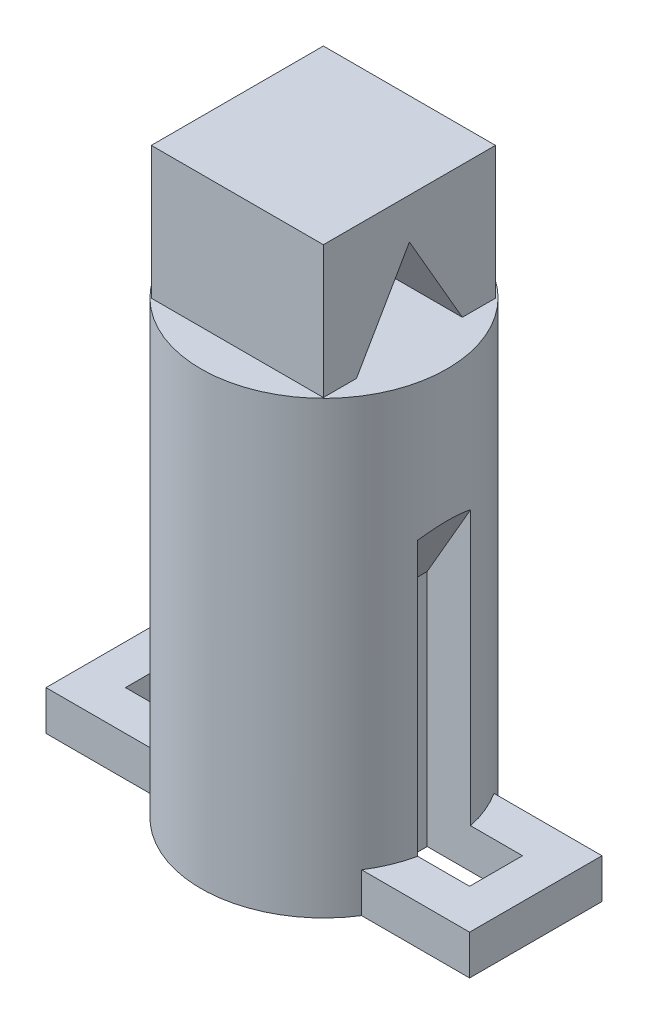
ISO-10303-21;
HEADER;
FILE_DESCRIPTION(('STEP AP214'),'2;1');
FILE_NAME('part.step','',(''),(''),'','','');
FILE_SCHEMA(('AUTOMOTIVE_DESIGN { 1 0 10303 214 1 1 1 1 }'));
ENDSEC;
DATA;
#1=APPLICATION_CONTEXT('core data for automotive mechanical design processes');
#2=APPLICATION_PROTOCOL_DEFINITION('international standard','automotive_design',2000,#1);
#3=PRODUCT_CONTEXT('',#1,'mechanical');
#4=PRODUCT('Part','Part','',(#3));
#5=PRODUCT_RELATED_PRODUCT_CATEGORY('part','',(#4));
#6=PRODUCT_DEFINITION_FORMATION('','',#4);
#7=PRODUCT_DEFINITION_CONTEXT('part definition',#1,'design');
#8=PRODUCT_DEFINITION('design','',#6,#7);
#9=PRODUCT_DEFINITION_SHAPE('','',#8);
#10=(LENGTH_UNIT() NAMED_UNIT(*) SI_UNIT(.MILLI.,.METRE.));
#11=(NAMED_UNIT(*) PLANE_ANGLE_UNIT() SI_UNIT($,.RADIAN.));
#12=(NAMED_UNIT(*) SI_UNIT($,.STERADIAN.) SOLID_ANGLE_UNIT());
#13=UNCERTAINTY_MEASURE_WITH_UNIT(LENGTH_MEASURE(1.E-05),#10,'distance_accuracy_value','');
#14=(GEOMETRIC_REPRESENTATION_CONTEXT(3) GLOBAL_UNCERTAINTY_ASSIGNED_CONTEXT((#13)) GLOBAL_UNIT_ASSIGNED_CONTEXT((#10,
#11,#12)) REPRESENTATION_CONTEXT('',''));
#15=CARTESIAN_POINT('',(0.,0.,0.));
#16=DIRECTION('',(0.,0.,1.));
#17=DIRECTION('',(1.,0.,0.));
#18=AXIS2_PLACEMENT_3D('',#15,#16,#17);
#19=CARTESIAN_POINT('',(-6.5,10.,-6.45306212472906));
#20=DIRECTION('',(1.,0.,0.));
#21=DIRECTION('',(0.,0.,-1.));
#22=AXIS2_PLACEMENT_3D('',#19,#20,#21);
#23=PLANE('',#22);
#24=DIRECTION('',(0.,0.,1.));
#25=VECTOR('',#24,1.);
#26=CARTESIAN_POINT('',(-6.5,0.,-6.45306212472906));
#27=LINE('',#26,#25);
#28=CARTESIAN_POINT('',(-6.5,0.,-6.45306212472906));
#29=VERTEX_POINT('',#28);
#30=CARTESIAN_POINT('',(-6.5,0.,-3.95306212472906));
#31=VERTEX_POINT('',#30);
#32=EDGE_CURVE('E439',#29,#31,#27,.T.);
#33=ORIENTED_EDGE('',*,*,#32,.T.);
#34=DIRECTION('',(0.,0.86602540378444,0.499999999999998));
#35=VECTOR('',#34,1.);
#36=CARTESIAN_POINT('',(-6.5,6.41746824526948,-0.24793510580687));
#37=LINE('',#36,#35);
#38=CARTESIAN_POINT('',(-6.49999999999999,6.92820323027555,0.0469378752709429));
#39=VERTEX_POINT('',#38);
#40=EDGE_CURVE('E299',#31,#39,#37,.T.);
#41=ORIENTED_EDGE('',*,*,#40,.T.);
#42=DIRECTION('',(0.,-0.86602540378444,0.499999999999998));
#43=VECTOR('',#42,1.);
#44=CARTESIAN_POINT('',(-6.5,12.0466333698683,-2.90818914365122));
#45=LINE('',#44,#43);
#46=CARTESIAN_POINT('',(-6.49999999999999,0.,4.04693787527094));
#47=VERTEX_POINT('',#46);
#48=EDGE_CURVE('E291',#39,#47,#45,.T.);
#49=ORIENTED_EDGE('',*,*,#48,.T.);
#50=CARTESIAN_POINT('',(-6.5,0.,6.54693787527094));
#51=VERTEX_POINT('',#50);
#52=EDGE_CURVE('E444',#47,#51,#27,.T.);
#53=ORIENTED_EDGE('',*,*,#52,.T.);
#54=DIRECTION('',(0.,-1.,0.));
#55=VECTOR('',#54,1.);
#56=CARTESIAN_POINT('',(-6.5,10.,6.54693787527094));
#57=LINE('',#56,#55);
#58=CARTESIAN_POINT('',(-6.5,10.,6.54693787527094));
#59=VERTEX_POINT('',#58);
#60=EDGE_CURVE('E467',#59,#51,#57,.T.);
#61=ORIENTED_EDGE('',*,*,#60,.F.);
#62=DIRECTION('',(0.,0.,1.));
#63=VECTOR('',#62,1.);
#64=CARTESIAN_POINT('',(-6.5,10.,-6.45306212472906));
#65=LINE('',#64,#63);
#66=CARTESIAN_POINT('',(-6.5,10.,-6.45306212472906));
#67=VERTEX_POINT('',#66);
#68=EDGE_CURVE('E424',#67,#59,#65,.T.);
#69=ORIENTED_EDGE('',*,*,#68,.F.);
#70=DIRECTION('',(0.,-1.,0.));
#71=VECTOR('',#70,1.);
#72=CARTESIAN_POINT('',(-6.5,10.,-6.45306212472906));
#73=LINE('',#72,#71);
#74=EDGE_CURVE('E438',#67,#29,#73,.T.);
#75=ORIENTED_EDGE('',*,*,#74,.T.);
#76=EDGE_LOOP('',(#33,#41,#49,#53,#61,#69,#75));
#77=FACE_BOUND('',#76,.T.);
#78=ADVANCED_FACE('F39',(#77),#23,.F.);
#79=CARTESIAN_POINT('',(6.5,10.,6.54693787527094));
#80=DIRECTION('',(0.,0.,-1.));
#81=DIRECTION('',(-1.,0.,0.));
#82=AXIS2_PLACEMENT_3D('',#79,#80,#81);
#83=PLANE('',#82);
#84=DIRECTION('',(1.,0.,0.));
#85=VECTOR('',#84,1.);
#86=CARTESIAN_POINT('',(6.5,0.,6.54693787527094));
#87=LINE('',#86,#85);
#88=CARTESIAN_POINT('',(6.5,0.,6.54693787527094));
#89=VERTEX_POINT('',#88);
#90=EDGE_CURVE('E443',#51,#89,#87,.T.);
#91=ORIENTED_EDGE('',*,*,#90,.T.);
#92=DIRECTION('',(0.,-1.,0.));
#93=VECTOR('',#92,1.);
#94=CARTESIAN_POINT('',(6.5,10.,6.54693787527094));
#95=LINE('',#94,#93);
#96=CARTESIAN_POINT('',(6.5,10.,6.54693787527094));
#97=VERTEX_POINT('',#96);
#98=EDGE_CURVE('E463',#97,#89,#95,.T.);
#99=ORIENTED_EDGE('',*,*,#98,.F.);
#100=DIRECTION('',(1.,0.,0.));
#101=VECTOR('',#100,1.);
#102=CARTESIAN_POINT('',(6.5,10.,6.54693787527094));
#103=LINE('',#102,#101);
#104=EDGE_CURVE('E428',#59,#97,#103,.T.);
#105=ORIENTED_EDGE('',*,*,#104,.F.);
#106=ORIENTED_EDGE('',*,*,#60,.T.);
#107=EDGE_LOOP('',(#91,#99,#105,#106));
#108=FACE_BOUND('',#107,.T.);
#109=ADVANCED_FACE('F573',(#108),#83,.F.);
#110=CARTESIAN_POINT('',(6.5,10.,-6.45306212472906));
#111=DIRECTION('',(-1.,0.,0.));
#112=DIRECTION('',(0.,0.,1.));
#113=AXIS2_PLACEMENT_3D('',#110,#111,#112);
#114=PLANE('',#113);
#115=DIRECTION('',(0.,0.86602540378444,-0.499999999999998));
#116=VECTOR('',#115,1.);
#117=CARTESIAN_POINT('',(6.5,12.0466333698683,-2.90818914365122));
#118=LINE('',#117,#116);
#119=CARTESIAN_POINT('',(6.5,0.,4.04693787527094));
#120=VERTEX_POINT('',#119);
#121=CARTESIAN_POINT('',(6.5,6.92820323027555,0.0469378752709412));
#122=VERTEX_POINT('',#121);
#123=EDGE_CURVE('E282',#120,#122,#118,.T.);
#124=ORIENTED_EDGE('',*,*,#123,.T.);
#125=DIRECTION('',(0.,-0.86602540378444,-0.499999999999998));
#126=VECTOR('',#125,1.);
#127=CARTESIAN_POINT('',(6.5,6.41746824526948,-0.247935105806871));
#128=LINE('',#127,#126);
#129=CARTESIAN_POINT('',(6.5,0.,-3.95306212472906));
#130=VERTEX_POINT('',#129);
#131=EDGE_CURVE('E295',#122,#130,#128,.T.);
#132=ORIENTED_EDGE('',*,*,#131,.T.);
#133=DIRECTION('',(0.,0.,-1.));
#134=VECTOR('',#133,1.);
#135=CARTESIAN_POINT('',(6.5,0.,-6.45306212472906));
#136=LINE('',#135,#134);
#137=CARTESIAN_POINT('',(6.5,0.,-6.45306212472906));
#138=VERTEX_POINT('',#137);
#139=EDGE_CURVE('E448',#130,#138,#136,.T.);
#140=ORIENTED_EDGE('',*,*,#139,.T.);
#141=DIRECTION('',(0.,-1.,0.));
#142=VECTOR('',#141,1.);
#143=CARTESIAN_POINT('',(6.5,10.,-6.45306212472906));
#144=LINE('',#143,#142);
#145=CARTESIAN_POINT('',(6.5,10.,-6.45306212472906));
#146=VERTEX_POINT('',#145);
#147=EDGE_CURVE('E459',#146,#138,#144,.T.);
#148=ORIENTED_EDGE('',*,*,#147,.F.);
#149=DIRECTION('',(0.,0.,-1.));
#150=VECTOR('',#149,1.);
#151=CARTESIAN_POINT('',(6.5,10.,-6.45306212472906));
#152=LINE('',#151,#150);
#153=EDGE_CURVE('E432',#97,#146,#152,.T.);
#154=ORIENTED_EDGE('',*,*,#153,.F.);
#155=ORIENTED_EDGE('',*,*,#98,.T.);
#156=EDGE_CURVE('E449',#89,#120,#136,.T.);
#157=ORIENTED_EDGE('',*,*,#156,.T.);
#158=EDGE_LOOP('',(#124,#132,#140,#148,#154,#155,#157));
#159=FACE_BOUND('',#158,.T.);
#160=ADVANCED_FACE('F579',(#159),#114,.F.);
#161=CARTESIAN_POINT('',(6.5,10.,-6.45306212472906));
#162=DIRECTION('',(0.,0.,1.));
#163=DIRECTION('',(1.,0.,0.));
#164=AXIS2_PLACEMENT_3D('',#161,#162,#163);
#165=PLANE('',#164);
#166=DIRECTION('',(-1.,0.,0.));
#167=VECTOR('',#166,1.);
#168=CARTESIAN_POINT('',(6.5,0.,-6.45306212472906));
#169=LINE('',#168,#167);
#170=EDGE_CURVE('E429',#138,#29,#169,.T.);
#171=ORIENTED_EDGE('',*,*,#170,.T.);
#172=ORIENTED_EDGE('',*,*,#74,.F.);
#173=DIRECTION('',(-1.,0.,0.));
#174=VECTOR('',#173,1.);
#175=CARTESIAN_POINT('',(6.5,10.,-6.45306212472906));
#176=LINE('',#175,#174);
#177=EDGE_CURVE('E435',#146,#67,#176,.T.);
#178=ORIENTED_EDGE('',*,*,#177,.F.);
#179=ORIENTED_EDGE('',*,*,#147,.T.);
#180=EDGE_LOOP('',(#171,#172,#178,#179));
#181=FACE_BOUND('',#180,.T.);
#182=ADVANCED_FACE('F739',(#181),#165,.F.);
#183=CARTESIAN_POINT('',(0.,10.,0.));
#184=DIRECTION('',(0.,-1.,0.));
#185=DIRECTION('',(0.,0.,-1.));
#186=AXIS2_PLACEMENT_3D('',#183,#184,#185);
#187=PLANE('',#186);
#188=ORIENTED_EDGE('',*,*,#68,.T.);
#189=ORIENTED_EDGE('',*,*,#104,.T.);
#190=ORIENTED_EDGE('',*,*,#153,.T.);
#191=ORIENTED_EDGE('',*,*,#177,.T.);
#192=EDGE_LOOP('',(#188,#189,#190,#191));
#193=FACE_BOUND('',#192,.T.);
#194=ADVANCED_FACE('F758',(#193),#187,.F.);
#195=CARTESIAN_POINT('',(0.,-34.,0.));
#196=DIRECTION('',(0.,1.,0.));
#197=DIRECTION('',(0.,0.,1.));
#198=AXIS2_PLACEMENT_3D('',#195,#196,#197);
#199=CYLINDRICAL_SURFACE('',#198,9.3);
#200=CARTESIAN_POINT('',(0.,-31.,0.));
#201=DIRECTION('',(0.,-1.,0.));
#202=DIRECTION('',(0.,0.,-1.));
#203=AXIS2_PLACEMENT_3D('',#200,#201,#202);
#204=CIRCLE('',#203,9.3);
#205=CARTESIAN_POINT('',(-9.08240056372763,-31.,-2.));
#206=VERTEX_POINT('',#205);
#207=CARTESIAN_POINT('',(-7.84155596804614,-31.,-5.));
#208=VERTEX_POINT('',#207);
#209=EDGE_CURVE('E547',#206,#208,#204,.T.);
#210=ORIENTED_EDGE('',*,*,#209,.F.);
#211=DIRECTION('',(0.,1.,0.));
#212=VECTOR('',#211,1.);
#213=CARTESIAN_POINT('',(-9.08240056372763,-34.,-2.));
#214=LINE('',#213,#212);
#215=CARTESIAN_POINT('',(-9.08240056372763,-10.3147154528311,-2.));
#216=VERTEX_POINT('',#215);
#217=EDGE_CURVE('E268',#206,#216,#214,.T.);
#218=ORIENTED_EDGE('',*,*,#217,.T.);
#219=CARTESIAN_POINT('',(0.,-26.0458946838994,0.));
#220=DIRECTION('',(0.866025403784435,0.500000000000006,0.));
#221=DIRECTION('',(-0.500000000000006,0.866025403784435,0.));
#222=AXIS2_PLACEMENT_3D('',#219,#220,#221);
#223=ELLIPSE('',#222,18.5999999999998,9.3);
#224=CARTESIAN_POINT('',(-9.08240056372763,-10.3147154528311,2.));
#225=VERTEX_POINT('',#224);
#226=EDGE_CURVE('E11',#216,#225,#223,.T.);
#227=ORIENTED_EDGE('',*,*,#226,.T.);
#228=DIRECTION('',(0.,1.,0.));
#229=VECTOR('',#228,1.);
#230=CARTESIAN_POINT('',(-9.08240056372763,-34.,2.));
#231=LINE('',#230,#229);
#232=CARTESIAN_POINT('',(-9.08240056372763,-31.,2.));
#233=VERTEX_POINT('',#232);
#234=EDGE_CURVE('E233',#225,#233,#231,.F.);
#235=ORIENTED_EDGE('',*,*,#234,.T.);
#236=CARTESIAN_POINT('',(-7.84155596804614,-31.,5.));
#237=VERTEX_POINT('',#236);
#238=EDGE_CURVE('E476',#237,#233,#204,.T.);
#239=ORIENTED_EDGE('',*,*,#238,.F.);
#240=DIRECTION('',(0.,1.,0.));
#241=VECTOR('',#240,1.);
#242=CARTESIAN_POINT('',(-7.84155596804614,-34.,5.));
#243=LINE('',#242,#241);
#244=CARTESIAN_POINT('',(-7.84155596804614,-34.,5.));
#245=VERTEX_POINT('',#244);
#246=EDGE_CURVE('E394',#237,#245,#243,.F.);
#247=ORIENTED_EDGE('',*,*,#246,.T.);
#248=CARTESIAN_POINT('',(0.,-34.,0.));
#249=DIRECTION('',(0.,-1.,0.));
#250=DIRECTION('',(0.,0.,-1.));
#251=AXIS2_PLACEMENT_3D('',#248,#249,#250);
#252=CIRCLE('',#251,9.3);
#253=CARTESIAN_POINT('',(7.84155596804614,-34.,5.));
#254=VERTEX_POINT('',#253);
#255=EDGE_CURVE('E420',#254,#245,#252,.T.);
#256=ORIENTED_EDGE('',*,*,#255,.F.);
#257=DIRECTION('',(0.,1.,0.));
#258=VECTOR('',#257,1.);
#259=CARTESIAN_POINT('',(7.84155596804614,-34.,5.));
#260=LINE('',#259,#258);
#261=CARTESIAN_POINT('',(7.84155596804614,-31.,5.));
#262=VERTEX_POINT('',#261);
#263=EDGE_CURVE('E406',#254,#262,#260,.T.);
#264=ORIENTED_EDGE('',*,*,#263,.T.);
#265=CARTESIAN_POINT('',(9.08240056372763,-31.,2.));
#266=VERTEX_POINT('',#265);
#267=EDGE_CURVE('E475',#266,#262,#204,.T.);
#268=ORIENTED_EDGE('',*,*,#267,.F.);
#269=DIRECTION('',(0.,1.,0.));
#270=VECTOR('',#269,1.);
#271=CARTESIAN_POINT('',(9.08240056372763,-34.,2.));
#272=LINE('',#271,#270);
#273=CARTESIAN_POINT('',(9.08240056372763,-10.3147154528311,2.));
#274=VERTEX_POINT('',#273);
#275=EDGE_CURVE('E274',#266,#274,#272,.T.);
#276=ORIENTED_EDGE('',*,*,#275,.T.);
#277=CARTESIAN_POINT('',(0.,-26.0458946838994,0.));
#278=DIRECTION('',(-0.866025403784435,0.500000000000006,0.));
#279=DIRECTION('',(0.500000000000006,0.866025403784435,0.));
#280=AXIS2_PLACEMENT_3D('',#277,#278,#279);
#281=ELLIPSE('',#280,18.5999999999998,9.3);
#282=CARTESIAN_POINT('',(9.08240056372763,-10.3147154528311,-2.));
#283=VERTEX_POINT('',#282);
#284=EDGE_CURVE('E48',#274,#283,#281,.T.);
#285=ORIENTED_EDGE('',*,*,#284,.T.);
#286=DIRECTION('',(0.,1.,0.));
#287=VECTOR('',#286,1.);
#288=CARTESIAN_POINT('',(9.08240056372763,-34.,-2.));
#289=LINE('',#288,#287);
#290=CARTESIAN_POINT('',(9.08240056372763,-31.,-2.));
#291=VERTEX_POINT('',#290);
#292=EDGE_CURVE('E271',#283,#291,#289,.F.);
#293=ORIENTED_EDGE('',*,*,#292,.T.);
#294=CARTESIAN_POINT('',(7.84155596804614,-31.,-5.));
#295=VERTEX_POINT('',#294);
#296=EDGE_CURVE('E471',#295,#291,#204,.T.);
#297=ORIENTED_EDGE('',*,*,#296,.F.);
#298=DIRECTION('',(0.,1.,0.));
#299=VECTOR('',#298,1.);
#300=CARTESIAN_POINT('',(7.84155596804614,-34.,-5.));
#301=LINE('',#300,#299);
#302=CARTESIAN_POINT('',(7.84155596804614,-34.,-5.));
#303=VERTEX_POINT('',#302);
#304=EDGE_CURVE('E409',#295,#303,#301,.F.);
#305=ORIENTED_EDGE('',*,*,#304,.T.);
#306=CARTESIAN_POINT('',(-7.84155596804614,-34.,-5.));
#307=VERTEX_POINT('',#306);
#308=EDGE_CURVE('E416',#307,#303,#252,.T.);
#309=ORIENTED_EDGE('',*,*,#308,.F.);
#310=DIRECTION('',(0.,1.,0.));
#311=VECTOR('',#310,1.);
#312=CARTESIAN_POINT('',(-7.84155596804614,-34.,-5.));
#313=LINE('',#312,#311);
#314=EDGE_CURVE('E412',#307,#208,#313,.T.);
#315=ORIENTED_EDGE('',*,*,#314,.T.);
#316=EDGE_LOOP('',(#210,#218,#227,#235,#239,#247,#256,#264,#268,#276,#285,#293,#297,#305,#309,#315));
#317=FACE_BOUND('',#316,.T.);
#318=CARTESIAN_POINT('',(0.,0.,0.));
#319=DIRECTION('',(0.,-1.,0.));
#320=DIRECTION('',(0.,0.,-1.));
#321=AXIS2_PLACEMENT_3D('',#318,#319,#320);
#322=CIRCLE('',#321,9.3);
#323=CARTESIAN_POINT('',(0.,0.,-9.3));
#324=VERTEX_POINT('',#323);
#325=EDGE_CURVE('E415',#324,#324,#322,.T.);
#326=ORIENTED_EDGE('',*,*,#325,.T.);
#327=EDGE_LOOP('',(#326));
#328=FACE_BOUND('',#327,.T.);
#329=ADVANCED_FACE('F495',(#317,#328),#199,.T.);
#330=CARTESIAN_POINT('',(0.,-34.,0.));
#331=DIRECTION('',(0.,-1.,0.));
#332=DIRECTION('',(0.,0.,-1.));
#333=AXIS2_PLACEMENT_3D('',#330,#331,#332);
#334=PLANE('',#333);
#335=DIRECTION('',(0.,0.,1.));
#336=VECTOR('',#335,1.);
#337=CARTESIAN_POINT('',(-5.8,-34.,-2.));
#338=LINE('',#337,#336);
#339=CARTESIAN_POINT('',(-5.8,-34.,-2.));
#340=VERTEX_POINT('',#339);
#341=CARTESIAN_POINT('',(-5.8,-34.,2.));
#342=VERTEX_POINT('',#341);
#343=EDGE_CURVE('E230',#340,#342,#338,.T.);
#344=ORIENTED_EDGE('',*,*,#343,.F.);
#345=DIRECTION('',(1.,0.,0.));
#346=VECTOR('',#345,1.);
#347=CARTESIAN_POINT('',(-5.8,-34.,-2.));
#348=LINE('',#347,#346);
#349=CARTESIAN_POINT('',(-13.,-34.,-2.));
#350=VERTEX_POINT('',#349);
#351=EDGE_CURVE('E238',#350,#340,#348,.T.);
#352=ORIENTED_EDGE('',*,*,#351,.F.);
#353=DIRECTION('',(0.,0.,-1.));
#354=VECTOR('',#353,1.);
#355=CARTESIAN_POINT('',(-13.,-34.,2.));
#356=LINE('',#355,#354);
#357=CARTESIAN_POINT('',(-13.,-34.,2.));
#358=VERTEX_POINT('',#357);
#359=EDGE_CURVE('E246',#358,#350,#356,.T.);
#360=ORIENTED_EDGE('',*,*,#359,.F.);
#361=DIRECTION('',(-1.,0.,0.));
#362=VECTOR('',#361,1.);
#363=CARTESIAN_POINT('',(-5.8,-34.,2.));
#364=LINE('',#363,#362);
#365=EDGE_CURVE('E245',#342,#358,#364,.T.);
#366=ORIENTED_EDGE('',*,*,#365,.F.);
#367=EDGE_LOOP('',(#344,#352,#360,#366));
#368=FACE_BOUND('',#367,.T.);
#369=DIRECTION('',(0.,0.,-1.));
#370=VECTOR('',#369,1.);
#371=CARTESIAN_POINT('',(5.8,-34.,2.));
#372=LINE('',#371,#370);
#373=CARTESIAN_POINT('',(5.8,-34.,2.));
#374=VERTEX_POINT('',#373);
#375=CARTESIAN_POINT('',(5.8,-34.,-2.));
#376=VERTEX_POINT('',#375);
#377=EDGE_CURVE('E260',#374,#376,#372,.T.);
#378=ORIENTED_EDGE('',*,*,#377,.F.);
#379=DIRECTION('',(-1.,0.,0.));
#380=VECTOR('',#379,1.);
#381=CARTESIAN_POINT('',(5.8,-34.,2.));
#382=LINE('',#381,#380);
#383=CARTESIAN_POINT('',(13.,-34.,2.));
#384=VERTEX_POINT('',#383);
#385=EDGE_CURVE('E303',#384,#374,#382,.T.);
#386=ORIENTED_EDGE('',*,*,#385,.F.);
#387=DIRECTION('',(0.,0.,1.));
#388=VECTOR('',#387,1.);
#389=CARTESIAN_POINT('',(13.,-34.,2.));
#390=LINE('',#389,#388);
#391=CARTESIAN_POINT('',(13.,-34.,-2.));
#392=VERTEX_POINT('',#391);
#393=EDGE_CURVE('E309',#392,#384,#390,.T.);
#394=ORIENTED_EDGE('',*,*,#393,.F.);
#395=DIRECTION('',(1.,0.,0.));
#396=VECTOR('',#395,1.);
#397=CARTESIAN_POINT('',(5.8,-34.,-2.));
#398=LINE('',#397,#396);
#399=EDGE_CURVE('E320',#376,#392,#398,.T.);
#400=ORIENTED_EDGE('',*,*,#399,.F.);
#401=EDGE_LOOP('',(#378,#386,#394,#400));
#402=FACE_BOUND('',#401,.T.);
#403=ORIENTED_EDGE('',*,*,#255,.T.);
#404=DIRECTION('',(-1.,0.,0.));
#405=VECTOR('',#404,1.);
#406=CARTESIAN_POINT('',(-16.,-34.,5.));
#407=LINE('',#406,#405);
#408=CARTESIAN_POINT('',(-16.,-34.,5.));
#409=VERTEX_POINT('',#408);
#410=EDGE_CURVE('E377',#245,#409,#407,.T.);
#411=ORIENTED_EDGE('',*,*,#410,.T.);
#412=DIRECTION('',(0.,0.,-1.));
#413=VECTOR('',#412,1.);
#414=CARTESIAN_POINT('',(-16.,-34.,5.));
#415=LINE('',#414,#413);
#416=CARTESIAN_POINT('',(-16.,-34.,-5.));
#417=VERTEX_POINT('',#416);
#418=EDGE_CURVE('E382',#409,#417,#415,.T.);
#419=ORIENTED_EDGE('',*,*,#418,.T.);
#420=DIRECTION('',(1.,0.,0.));
#421=VECTOR('',#420,1.);
#422=CARTESIAN_POINT('',(-16.,-34.,-5.));
#423=LINE('',#422,#421);
#424=EDGE_CURVE('E359',#417,#307,#423,.T.);
#425=ORIENTED_EDGE('',*,*,#424,.T.);
#426=ORIENTED_EDGE('',*,*,#308,.T.);
#427=CARTESIAN_POINT('',(16.,-34.,-5.));
#428=VERTEX_POINT('',#427);
#429=EDGE_CURVE('E386',#303,#428,#423,.T.);
#430=ORIENTED_EDGE('',*,*,#429,.T.);
#431=DIRECTION('',(0.,0.,1.));
#432=VECTOR('',#431,1.);
#433=CARTESIAN_POINT('',(16.,-34.,5.));
#434=LINE('',#433,#432);
#435=CARTESIAN_POINT('',(16.,-34.,5.));
#436=VERTEX_POINT('',#435);
#437=EDGE_CURVE('E351',#428,#436,#434,.T.);
#438=ORIENTED_EDGE('',*,*,#437,.T.);
#439=EDGE_CURVE('E378',#436,#254,#407,.T.);
#440=ORIENTED_EDGE('',*,*,#439,.T.);
#441=EDGE_LOOP('',(#403,#411,#419,#425,#426,#430,#438,#440));
#442=FACE_BOUND('',#441,.T.);
#443=ADVANCED_FACE('F249',(#368,#402,#442),#334,.T.);
#444=CARTESIAN_POINT('',(0.,0.,0.));
#445=DIRECTION('',(0.,-1.,0.));
#446=DIRECTION('',(0.,0.,-1.));
#447=AXIS2_PLACEMENT_3D('',#444,#445,#446);
#448=PLANE('',#447);
#449=ORIENTED_EDGE('',*,*,#52,.F.);
#450=DIRECTION('',(-1.,0.,0.));
#451=VECTOR('',#450,1.);
#452=CARTESIAN_POINT('',(16.,0.,4.04693787527094));
#453=LINE('',#452,#451);
#454=EDGE_CURVE('E283',#120,#47,#453,.T.);
#455=ORIENTED_EDGE('',*,*,#454,.F.);
#456=ORIENTED_EDGE('',*,*,#156,.F.);
#457=ORIENTED_EDGE('',*,*,#90,.F.);
#458=EDGE_LOOP('',(#449,#455,#456,#457));
#459=FACE_BOUND('',#458,.T.);
#460=DIRECTION('',(-1.,0.,0.));
#461=VECTOR('',#460,1.);
#462=CARTESIAN_POINT('',(16.,0.,-3.95306212472906));
#463=LINE('',#462,#461);
#464=EDGE_CURVE('E277',#130,#31,#463,.T.);
#465=ORIENTED_EDGE('',*,*,#464,.T.);
#466=ORIENTED_EDGE('',*,*,#32,.F.);
#467=ORIENTED_EDGE('',*,*,#170,.F.);
#468=ORIENTED_EDGE('',*,*,#139,.F.);
#469=EDGE_LOOP('',(#465,#466,#467,#468));
#470=FACE_BOUND('',#469,.T.);
#471=ORIENTED_EDGE('',*,*,#325,.F.);
#472=EDGE_LOOP('',(#471));
#473=FACE_BOUND('',#472,.T.);
#474=ADVANCED_FACE('F568',(#459,#470,#473),#448,.F.);
#475=CARTESIAN_POINT('',(13.,-31.,2.));
#476=DIRECTION('',(1.,0.,0.));
#477=DIRECTION('',(0.,0.,-1.));
#478=AXIS2_PLACEMENT_3D('',#475,#476,#477);
#479=PLANE('',#478);
#480=ORIENTED_EDGE('',*,*,#393,.T.);
#481=DIRECTION('',(0.,-1.,0.));
#482=VECTOR('',#481,1.);
#483=CARTESIAN_POINT('',(13.,-31.,2.));
#484=LINE('',#483,#482);
#485=CARTESIAN_POINT('',(13.,-31.,2.));
#486=VERTEX_POINT('',#485);
#487=EDGE_CURVE('E326',#486,#384,#484,.T.);
#488=ORIENTED_EDGE('',*,*,#487,.F.);
#489=DIRECTION('',(0.,0.,1.));
#490=VECTOR('',#489,1.);
#491=CARTESIAN_POINT('',(13.,-31.,2.));
#492=LINE('',#491,#490);
#493=CARTESIAN_POINT('',(13.,-31.,-2.));
#494=VERTEX_POINT('',#493);
#495=EDGE_CURVE('E312',#494,#486,#492,.T.);
#496=ORIENTED_EDGE('',*,*,#495,.F.);
#497=DIRECTION('',(0.,-1.,0.));
#498=VECTOR('',#497,1.);
#499=CARTESIAN_POINT('',(13.,-31.,-2.));
#500=LINE('',#499,#498);
#501=EDGE_CURVE('E316',#494,#392,#500,.T.);
#502=ORIENTED_EDGE('',*,*,#501,.T.);
#503=EDGE_LOOP('',(#480,#488,#496,#502));
#504=FACE_BOUND('',#503,.T.);
#505=ADVANCED_FACE('F516',(#504),#479,.F.);
#506=CARTESIAN_POINT('',(16.,-31.,5.));
#507=DIRECTION('',(1.,0.,0.));
#508=DIRECTION('',(0.,0.,-1.));
#509=AXIS2_PLACEMENT_3D('',#506,#507,#508);
#510=PLANE('',#509);
#511=ORIENTED_EDGE('',*,*,#437,.F.);
#512=DIRECTION('',(0.,-1.,0.));
#513=VECTOR('',#512,1.);
#514=CARTESIAN_POINT('',(16.,-31.,-5.));
#515=LINE('',#514,#513);
#516=CARTESIAN_POINT('',(16.,-31.,-5.));
#517=VERTEX_POINT('',#516);
#518=EDGE_CURVE('E390',#517,#428,#515,.T.);
#519=ORIENTED_EDGE('',*,*,#518,.F.);
#520=DIRECTION('',(0.,0.,1.));
#521=VECTOR('',#520,1.);
#522=CARTESIAN_POINT('',(16.,-31.,5.));
#523=LINE('',#522,#521);
#524=CARTESIAN_POINT('',(16.,-31.,5.));
#525=VERTEX_POINT('',#524);
#526=EDGE_CURVE('E354',#517,#525,#523,.T.);
#527=ORIENTED_EDGE('',*,*,#526,.T.);
#528=DIRECTION('',(0.,-1.,0.));
#529=VECTOR('',#528,1.);
#530=CARTESIAN_POINT('',(16.,-31.,5.));
#531=LINE('',#530,#529);
#532=EDGE_CURVE('E373',#525,#436,#531,.T.);
#533=ORIENTED_EDGE('',*,*,#532,.T.);
#534=EDGE_LOOP('',(#511,#519,#527,#533));
#535=FACE_BOUND('',#534,.T.);
#536=ADVANCED_FACE('F560',(#535),#510,.T.);
#537=CARTESIAN_POINT('',(5.8,-31.,-2.));
#538=DIRECTION('',(0.,0.,-1.));
#539=DIRECTION('',(-1.,0.,0.));
#540=AXIS2_PLACEMENT_3D('',#537,#538,#539);
#541=PLANE('',#540);
#542=ORIENTED_EDGE('',*,*,#292,.F.);
#543=DIRECTION('',(-0.500000000000006,-0.866025403784435,0.));
#544=VECTOR('',#543,1.);
#545=CARTESIAN_POINT('',(9.84145188432746,-9.,-2.));
#546=LINE('',#545,#544);
#547=CARTESIAN_POINT('',(5.8,-16.,-2.));
#548=VERTEX_POINT('',#547);
#549=EDGE_CURVE('E477',#283,#548,#546,.T.);
#550=ORIENTED_EDGE('',*,*,#549,.T.);
#551=DIRECTION('',(0.,-1.,0.));
#552=VECTOR('',#551,1.);
#553=CARTESIAN_POINT('',(5.8,-9.,-2.));
#554=LINE('',#553,#552);
#555=EDGE_CURVE('E257',#548,#376,#554,.T.);
#556=ORIENTED_EDGE('',*,*,#555,.T.);
#557=ORIENTED_EDGE('',*,*,#399,.T.);
#558=ORIENTED_EDGE('',*,*,#501,.F.);
#559=DIRECTION('',(1.,0.,0.));
#560=VECTOR('',#559,1.);
#561=CARTESIAN_POINT('',(5.8,-31.,-2.));
#562=LINE('',#561,#560);
#563=EDGE_CURVE('E308',#291,#494,#562,.T.);
#564=ORIENTED_EDGE('',*,*,#563,.F.);
#565=EDGE_LOOP('',(#542,#550,#556,#557,#558,#564));
#566=FACE_BOUND('',#565,.T.);
#567=ADVANCED_FACE('F501',(#566),#541,.F.);
#568=CARTESIAN_POINT('',(5.8,-31.,2.));
#569=DIRECTION('',(0.,0.,1.));
#570=DIRECTION('',(1.,0.,0.));
#571=AXIS2_PLACEMENT_3D('',#568,#569,#570);
#572=PLANE('',#571);
#573=DIRECTION('',(0.,-1.,0.));
#574=VECTOR('',#573,1.);
#575=CARTESIAN_POINT('',(5.8,-9.,2.));
#576=LINE('',#575,#574);
#577=CARTESIAN_POINT('',(5.8,-16.,2.));
#578=VERTEX_POINT('',#577);
#579=EDGE_CURVE('E252',#578,#374,#576,.T.);
#580=ORIENTED_EDGE('',*,*,#579,.F.);
#581=DIRECTION('',(0.500000000000006,0.866025403784435,0.));
#582=VECTOR('',#581,1.);
#583=CARTESIAN_POINT('',(9.84145188432746,-9.,2.));
#584=LINE('',#583,#582);
#585=EDGE_CURVE('E74',#578,#274,#584,.T.);
#586=ORIENTED_EDGE('',*,*,#585,.T.);
#587=ORIENTED_EDGE('',*,*,#275,.F.);
#588=DIRECTION('',(-1.,0.,0.));
#589=VECTOR('',#588,1.);
#590=CARTESIAN_POINT('',(5.8,-31.,2.));
#591=LINE('',#590,#589);
#592=EDGE_CURVE('E304',#486,#266,#591,.T.);
#593=ORIENTED_EDGE('',*,*,#592,.F.);
#594=ORIENTED_EDGE('',*,*,#487,.T.);
#595=ORIENTED_EDGE('',*,*,#385,.T.);
#596=EDGE_LOOP('',(#580,#586,#587,#593,#594,#595));
#597=FACE_BOUND('',#596,.T.);
#598=ADVANCED_FACE('F507',(#597),#572,.F.);
#599=CARTESIAN_POINT('',(-16.,-31.,5.));
#600=DIRECTION('',(0.,0.,1.));
#601=DIRECTION('',(1.,0.,0.));
#602=AXIS2_PLACEMENT_3D('',#599,#600,#601);
#603=PLANE('',#602);
#604=ORIENTED_EDGE('',*,*,#263,.F.);
#605=ORIENTED_EDGE('',*,*,#439,.F.);
#606=ORIENTED_EDGE('',*,*,#532,.F.);
#607=DIRECTION('',(-1.,0.,0.));
#608=VECTOR('',#607,1.);
#609=CARTESIAN_POINT('',(-16.,-31.,5.));
#610=LINE('',#609,#608);
#611=EDGE_CURVE('E360',#525,#262,#610,.T.);
#612=ORIENTED_EDGE('',*,*,#611,.T.);
#613=EDGE_LOOP('',(#604,#605,#606,#612));
#614=FACE_BOUND('',#613,.T.);
#615=ADVANCED_FACE('F557',(#614),#603,.T.);
#616=CARTESIAN_POINT('',(-16.,-31.,-5.));
#617=DIRECTION('',(0.,0.,-1.));
#618=DIRECTION('',(-1.,0.,0.));
#619=AXIS2_PLACEMENT_3D('',#616,#617,#618);
#620=PLANE('',#619);
#621=ORIENTED_EDGE('',*,*,#304,.F.);
#622=DIRECTION('',(1.,0.,0.));
#623=VECTOR('',#622,1.);
#624=CARTESIAN_POINT('',(-16.,-31.,-5.));
#625=LINE('',#624,#623);
#626=EDGE_CURVE('E368',#295,#517,#625,.T.);
#627=ORIENTED_EDGE('',*,*,#626,.T.);
#628=ORIENTED_EDGE('',*,*,#518,.T.);
#629=ORIENTED_EDGE('',*,*,#429,.F.);
#630=EDGE_LOOP('',(#621,#627,#628,#629));
#631=FACE_BOUND('',#630,.T.);
#632=ADVANCED_FACE('F525',(#631),#620,.T.);
#633=CARTESIAN_POINT('',(0.,-31.,0.));
#634=DIRECTION('',(0.,-1.,0.));
#635=DIRECTION('',(0.,0.,-1.));
#636=AXIS2_PLACEMENT_3D('',#633,#634,#635);
#637=PLANE('',#636);
#638=ORIENTED_EDGE('',*,*,#626,.F.);
#639=ORIENTED_EDGE('',*,*,#296,.T.);
#640=ORIENTED_EDGE('',*,*,#563,.T.);
#641=ORIENTED_EDGE('',*,*,#495,.T.);
#642=ORIENTED_EDGE('',*,*,#592,.T.);
#643=ORIENTED_EDGE('',*,*,#267,.T.);
#644=ORIENTED_EDGE('',*,*,#611,.F.);
#645=ORIENTED_EDGE('',*,*,#526,.F.);
#646=EDGE_LOOP('',(#638,#639,#640,#641,#642,#643,#644,#645));
#647=FACE_BOUND('',#646,.T.);
#648=ADVANCED_FACE('F519',(#647),#637,.F.);
#649=ORIENTED_EDGE('',*,*,#314,.F.);
#650=ORIENTED_EDGE('',*,*,#424,.F.);
#651=DIRECTION('',(0.,-1.,0.));
#652=VECTOR('',#651,1.);
#653=CARTESIAN_POINT('',(-16.,-31.,-5.));
#654=LINE('',#653,#652);
#655=CARTESIAN_POINT('',(-16.,-31.,-5.));
#656=VERTEX_POINT('',#655);
#657=EDGE_CURVE('E395',#656,#417,#654,.T.);
#658=ORIENTED_EDGE('',*,*,#657,.F.);
#659=EDGE_CURVE('E369',#656,#208,#625,.T.);
#660=ORIENTED_EDGE('',*,*,#659,.T.);
#661=EDGE_LOOP('',(#649,#650,#658,#660));
#662=FACE_BOUND('',#661,.T.);
#663=ADVANCED_FACE('F545',(#662),#620,.T.);
#664=ORIENTED_EDGE('',*,*,#246,.F.);
#665=CARTESIAN_POINT('',(-16.,-31.,5.));
#666=VERTEX_POINT('',#665);
#667=EDGE_CURVE('E358',#237,#666,#610,.T.);
#668=ORIENTED_EDGE('',*,*,#667,.T.);
#669=DIRECTION('',(0.,-1.,0.));
#670=VECTOR('',#669,1.);
#671=CARTESIAN_POINT('',(-16.,-31.,5.));
#672=LINE('',#671,#670);
#673=EDGE_CURVE('E398',#666,#409,#672,.T.);
#674=ORIENTED_EDGE('',*,*,#673,.T.);
#675=ORIENTED_EDGE('',*,*,#410,.F.);
#676=EDGE_LOOP('',(#664,#668,#674,#675));
#677=FACE_BOUND('',#676,.T.);
#678=ADVANCED_FACE('F537',(#677),#603,.T.);
#679=CARTESIAN_POINT('',(-5.8,-31.,2.));
#680=DIRECTION('',(0.,0.,1.));
#681=DIRECTION('',(1.,0.,0.));
#682=AXIS2_PLACEMENT_3D('',#679,#680,#681);
#683=PLANE('',#682);
#684=ORIENTED_EDGE('',*,*,#234,.F.);
#685=DIRECTION('',(0.500000000000006,-0.866025403784435,0.));
#686=VECTOR('',#685,1.);
#687=CARTESIAN_POINT('',(-9.84145188432746,-9.,2.));
#688=LINE('',#687,#686);
#689=CARTESIAN_POINT('',(-5.8,-16.,2.));
#690=VERTEX_POINT('',#689);
#691=EDGE_CURVE('E485',#225,#690,#688,.T.);
#692=ORIENTED_EDGE('',*,*,#691,.T.);
#693=DIRECTION('',(0.,-1.,0.));
#694=VECTOR('',#693,1.);
#695=CARTESIAN_POINT('',(-5.8,-9.,2.));
#696=LINE('',#695,#694);
#697=EDGE_CURVE('E234',#690,#342,#696,.T.);
#698=ORIENTED_EDGE('',*,*,#697,.T.);
#699=ORIENTED_EDGE('',*,*,#365,.T.);
#700=DIRECTION('',(0.,-1.,0.));
#701=VECTOR('',#700,1.);
#702=CARTESIAN_POINT('',(-13.,-31.,2.));
#703=LINE('',#702,#701);
#704=CARTESIAN_POINT('',(-13.,-31.,2.));
#705=VERTEX_POINT('',#704);
#706=EDGE_CURVE('E347',#705,#358,#703,.T.);
#707=ORIENTED_EDGE('',*,*,#706,.F.);
#708=DIRECTION('',(-1.,0.,0.));
#709=VECTOR('',#708,1.);
#710=CARTESIAN_POINT('',(-5.8,-31.,2.));
#711=LINE('',#710,#709);
#712=EDGE_CURVE('E340',#233,#705,#711,.T.);
#713=ORIENTED_EDGE('',*,*,#712,.F.);
#714=EDGE_LOOP('',(#684,#692,#698,#699,#707,#713));
#715=FACE_BOUND('',#714,.T.);
#716=ADVANCED_FACE('F605',(#715),#683,.F.);
#717=CARTESIAN_POINT('',(-5.8,-31.,-2.));
#718=DIRECTION('',(0.,0.,-1.));
#719=DIRECTION('',(-1.,0.,0.));
#720=AXIS2_PLACEMENT_3D('',#717,#718,#719);
#721=PLANE('',#720);
#722=DIRECTION('',(0.,-1.,0.));
#723=VECTOR('',#722,1.);
#724=CARTESIAN_POINT('',(-5.8,-9.,-2.));
#725=LINE('',#724,#723);
#726=CARTESIAN_POINT('',(-5.8,-16.,-2.));
#727=VERTEX_POINT('',#726);
#728=EDGE_CURVE('E225',#727,#340,#725,.T.);
#729=ORIENTED_EDGE('',*,*,#728,.F.);
#730=DIRECTION('',(-0.500000000000006,0.866025403784435,0.));
#731=VECTOR('',#730,1.);
#732=CARTESIAN_POINT('',(-9.84145188432746,-9.,-2.));
#733=LINE('',#732,#731);
#734=EDGE_CURVE('E55',#727,#216,#733,.T.);
#735=ORIENTED_EDGE('',*,*,#734,.T.);
#736=ORIENTED_EDGE('',*,*,#217,.F.);
#737=DIRECTION('',(1.,0.,0.));
#738=VECTOR('',#737,1.);
#739=CARTESIAN_POINT('',(-5.8,-31.,-2.));
#740=LINE('',#739,#738);
#741=CARTESIAN_POINT('',(-13.,-31.,-2.));
#742=VERTEX_POINT('',#741);
#743=EDGE_CURVE('E336',#742,#206,#740,.T.);
#744=ORIENTED_EDGE('',*,*,#743,.F.);
#745=DIRECTION('',(0.,-1.,0.));
#746=VECTOR('',#745,1.);
#747=CARTESIAN_POINT('',(-13.,-31.,-2.));
#748=LINE('',#747,#746);
#749=EDGE_CURVE('E241',#742,#350,#748,.T.);
#750=ORIENTED_EDGE('',*,*,#749,.T.);
#751=ORIENTED_EDGE('',*,*,#351,.T.);
#752=EDGE_LOOP('',(#729,#735,#736,#744,#750,#751));
#753=FACE_BOUND('',#752,.T.);
#754=ADVANCED_FACE('F239',(#753),#721,.F.);
#755=CARTESIAN_POINT('',(-16.,-31.,5.));
#756=DIRECTION('',(-1.,0.,0.));
#757=DIRECTION('',(0.,0.,1.));
#758=AXIS2_PLACEMENT_3D('',#755,#756,#757);
#759=PLANE('',#758);
#760=ORIENTED_EDGE('',*,*,#418,.F.);
#761=ORIENTED_EDGE('',*,*,#673,.F.);
#762=DIRECTION('',(0.,0.,-1.));
#763=VECTOR('',#762,1.);
#764=CARTESIAN_POINT('',(-16.,-31.,5.));
#765=LINE('',#764,#763);
#766=EDGE_CURVE('E364',#666,#656,#765,.T.);
#767=ORIENTED_EDGE('',*,*,#766,.T.);
#768=ORIENTED_EDGE('',*,*,#657,.T.);
#769=EDGE_LOOP('',(#760,#761,#767,#768));
#770=FACE_BOUND('',#769,.T.);
#771=ADVANCED_FACE('F541',(#770),#759,.T.);
#772=ORIENTED_EDGE('',*,*,#667,.F.);
#773=ORIENTED_EDGE('',*,*,#238,.T.);
#774=ORIENTED_EDGE('',*,*,#712,.T.);
#775=DIRECTION('',(0.,0.,-1.));
#776=VECTOR('',#775,1.);
#777=CARTESIAN_POINT('',(-13.,-31.,2.));
#778=LINE('',#777,#776);
#779=EDGE_CURVE('E332',#705,#742,#778,.T.);
#780=ORIENTED_EDGE('',*,*,#779,.T.);
#781=ORIENTED_EDGE('',*,*,#743,.T.);
#782=ORIENTED_EDGE('',*,*,#209,.T.);
#783=ORIENTED_EDGE('',*,*,#659,.F.);
#784=ORIENTED_EDGE('',*,*,#766,.F.);
#785=EDGE_LOOP('',(#772,#773,#774,#780,#781,#782,#783,#784));
#786=FACE_BOUND('',#785,.T.);
#787=ADVANCED_FACE('F549',(#786),#637,.F.);
#788=CARTESIAN_POINT('',(-13.,-31.,2.));
#789=DIRECTION('',(-1.,0.,0.));
#790=DIRECTION('',(0.,0.,1.));
#791=AXIS2_PLACEMENT_3D('',#788,#789,#790);
#792=PLANE('',#791);
#793=ORIENTED_EDGE('',*,*,#359,.T.);
#794=ORIENTED_EDGE('',*,*,#749,.F.);
#795=ORIENTED_EDGE('',*,*,#779,.F.);
#796=ORIENTED_EDGE('',*,*,#706,.T.);
#797=EDGE_LOOP('',(#793,#794,#795,#796));
#798=FACE_BOUND('',#797,.T.);
#799=ADVANCED_FACE('F600',(#798),#792,.F.);
#800=CARTESIAN_POINT('',(16.,0.,-3.95306212472906));
#801=DIRECTION('',(0.,0.499999999999998,-0.86602540378444));
#802=DIRECTION('',(0.,0.86602540378444,0.499999999999998));
#803=AXIS2_PLACEMENT_3D('',#800,#801,#802);
#804=PLANE('',#803);
#805=ORIENTED_EDGE('',*,*,#464,.F.);
#806=ORIENTED_EDGE('',*,*,#131,.F.);
#807=DIRECTION('',(-1.,0.,0.));
#808=VECTOR('',#807,1.);
#809=CARTESIAN_POINT('',(16.,6.92820323027555,0.0469378752709399));
#810=LINE('',#809,#808);
#811=EDGE_CURVE('E278',#122,#39,#810,.T.);
#812=ORIENTED_EDGE('',*,*,#811,.T.);
#813=ORIENTED_EDGE('',*,*,#40,.F.);
#814=EDGE_LOOP('',(#805,#806,#812,#813));
#815=FACE_BOUND('',#814,.T.);
#816=ADVANCED_FACE('F597',(#815),#804,.F.);
#817=CARTESIAN_POINT('',(16.,6.92820323027555,0.0469378752709399));
#818=DIRECTION('',(0.,0.499999999999998,0.86602540378444));
#819=DIRECTION('',(0.,-0.86602540378444,0.499999999999998));
#820=AXIS2_PLACEMENT_3D('',#817,#818,#819);
#821=PLANE('',#820);
#822=ORIENTED_EDGE('',*,*,#811,.F.);
#823=ORIENTED_EDGE('',*,*,#123,.F.);
#824=ORIENTED_EDGE('',*,*,#454,.T.);
#825=ORIENTED_EDGE('',*,*,#48,.F.);
#826=EDGE_LOOP('',(#822,#823,#824,#825));
#827=FACE_BOUND('',#826,.T.);
#828=ADVANCED_FACE('F592',(#827),#821,.F.);
#829=CARTESIAN_POINT('',(5.8,-9.,2.));
#830=DIRECTION('',(-1.,0.,0.));
#831=DIRECTION('',(0.,0.,1.));
#832=AXIS2_PLACEMENT_3D('',#829,#830,#831);
#833=PLANE('',#832);
#834=ORIENTED_EDGE('',*,*,#555,.F.);
#835=DIRECTION('',(0.,0.,1.));
#836=VECTOR('',#835,1.);
#837=CARTESIAN_POINT('',(5.8,-16.,2.));
#838=LINE('',#837,#836);
#839=EDGE_CURVE('E480',#548,#578,#838,.T.);
#840=ORIENTED_EDGE('',*,*,#839,.T.);
#841=ORIENTED_EDGE('',*,*,#579,.T.);
#842=ORIENTED_EDGE('',*,*,#377,.T.);
#843=EDGE_LOOP('',(#834,#840,#841,#842));
#844=FACE_BOUND('',#843,.T.);
#845=ADVANCED_FACE('F506',(#844),#833,.F.);
#846=CARTESIAN_POINT('',(-5.8,-9.,-2.));
#847=DIRECTION('',(1.,0.,0.));
#848=DIRECTION('',(0.,0.,-1.));
#849=AXIS2_PLACEMENT_3D('',#846,#847,#848);
#850=PLANE('',#849);
#851=ORIENTED_EDGE('',*,*,#697,.F.);
#852=DIRECTION('',(0.,0.,-1.));
#853=VECTOR('',#852,1.);
#854=CARTESIAN_POINT('',(-5.8,-16.,-2.));
#855=LINE('',#854,#853);
#856=EDGE_CURVE('E231',#690,#727,#855,.T.);
#857=ORIENTED_EDGE('',*,*,#856,.T.);
#858=ORIENTED_EDGE('',*,*,#728,.T.);
#859=ORIENTED_EDGE('',*,*,#343,.T.);
#860=EDGE_LOOP('',(#851,#857,#858,#859));
#861=FACE_BOUND('',#860,.T.);
#862=ADVANCED_FACE('F228',(#861),#850,.F.);
#863=CARTESIAN_POINT('',(9.84145188432746,-9.,0.));
#864=DIRECTION('',(-0.866025403784435,0.500000000000006,0.));
#865=DIRECTION('',(0.,0.,-1.));
#866=AXIS2_PLACEMENT_3D('',#863,#864,#865);
#867=PLANE('',#866);
#868=ORIENTED_EDGE('',*,*,#585,.F.);
#869=ORIENTED_EDGE('',*,*,#839,.F.);
#870=ORIENTED_EDGE('',*,*,#549,.F.);
#871=ORIENTED_EDGE('',*,*,#284,.F.);
#872=EDGE_LOOP('',(#868,#869,#870,#871));
#873=FACE_BOUND('',#872,.T.);
#874=ADVANCED_FACE('F504',(#873),#867,.F.);
#875=CARTESIAN_POINT('',(-9.84145188432746,-9.,0.));
#876=DIRECTION('',(0.866025403784435,0.500000000000006,0.));
#877=DIRECTION('',(0.,0.,1.));
#878=AXIS2_PLACEMENT_3D('',#875,#876,#877);
#879=PLANE('',#878);
#880=ORIENTED_EDGE('',*,*,#734,.F.);
#881=ORIENTED_EDGE('',*,*,#856,.F.);
#882=ORIENTED_EDGE('',*,*,#691,.F.);
#883=ORIENTED_EDGE('',*,*,#226,.F.);
#884=EDGE_LOOP('',(#880,#881,#882,#883));
#885=FACE_BOUND('',#884,.T.);
#886=ADVANCED_FACE('F41',(#885),#879,.F.);
#887=CLOSED_SHELL('',(#78,#109,#160,#182,#194,#329,#443,#474,#505,#536,#567,#598,#615,#632,#648,
#663,#678,#716,#754,#771,#787,#799,#816,#828,#845,#862,#874,#886));
#888=MANIFOLD_SOLID_BREP('B2',#887);
#889=ADVANCED_BREP_SHAPE_REPRESENTATION('',(#18,#888),#14);
#890=SHAPE_DEFINITION_REPRESENTATION(#9,#889);
ENDSEC;
END-ISO-10303-21;
